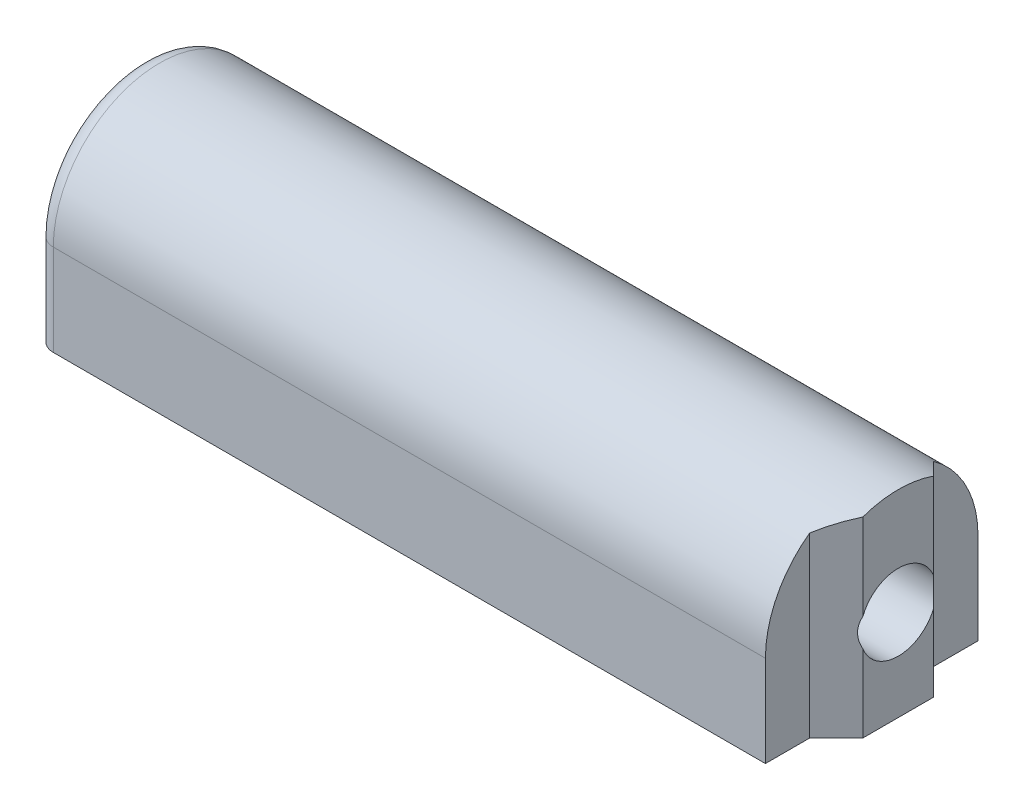
ISO-10303-21;
HEADER;
FILE_DESCRIPTION(('STEP AP214'),'2;1');
FILE_NAME('part.step','',(''),(''),'','','');
FILE_SCHEMA(('AUTOMOTIVE_DESIGN { 1 0 10303 214 1 1 1 1 }'));
ENDSEC;
DATA;
#1=APPLICATION_CONTEXT('core data for automotive mechanical design processes');
#2=APPLICATION_PROTOCOL_DEFINITION('international standard','automotive_design',2000,#1);
#3=PRODUCT_CONTEXT('',#1,'mechanical');
#4=PRODUCT('Part','Part','',(#3));
#5=PRODUCT_RELATED_PRODUCT_CATEGORY('part','',(#4));
#6=PRODUCT_DEFINITION_FORMATION('','',#4);
#7=PRODUCT_DEFINITION_CONTEXT('part definition',#1,'design');
#8=PRODUCT_DEFINITION('design','',#6,#7);
#9=PRODUCT_DEFINITION_SHAPE('','',#8);
#10=(LENGTH_UNIT() NAMED_UNIT(*) SI_UNIT(.MILLI.,.METRE.));
#11=(NAMED_UNIT(*) PLANE_ANGLE_UNIT() SI_UNIT($,.RADIAN.));
#12=(NAMED_UNIT(*) SI_UNIT($,.STERADIAN.) SOLID_ANGLE_UNIT());
#13=UNCERTAINTY_MEASURE_WITH_UNIT(LENGTH_MEASURE(1.E-05),#10,'distance_accuracy_value','');
#14=(GEOMETRIC_REPRESENTATION_CONTEXT(3) GLOBAL_UNCERTAINTY_ASSIGNED_CONTEXT((#13)) GLOBAL_UNIT_ASSIGNED_CONTEXT((#10,
#11,#12)) REPRESENTATION_CONTEXT('',''));
#15=CARTESIAN_POINT('',(0.,0.,0.));
#16=DIRECTION('',(0.,0.,1.));
#17=DIRECTION('',(1.,0.,0.));
#18=AXIS2_PLACEMENT_3D('',#15,#16,#17);
#19=CARTESIAN_POINT('',(42.7,-7.15891053163818,8.));
#20=DIRECTION('',(1.,0.,0.));
#21=DIRECTION('',(0.,0.,-1.));
#22=AXIS2_PLACEMENT_3D('',#19,#20,#21);
#23=PLANE('',#22);
#24=CARTESIAN_POINT('',(42.7,5.15,6.));
#25=DIRECTION('',(-1.,0.,0.));
#26=DIRECTION('',(0.,0.,1.));
#27=AXIS2_PLACEMENT_3D('',#24,#25,#26);
#28=CIRCLE('',#27,6.);
#29=CARTESIAN_POINT('',(42.7,10.8068542494924,4.));
#30=VERTEX_POINT('',#29);
#31=CARTESIAN_POINT('',(42.7,10.8068542494924,8.));
#32=VERTEX_POINT('',#31);
#33=EDGE_CURVE('E196',#30,#32,#28,.F.);
#34=ORIENTED_EDGE('',*,*,#33,.T.);
#35=DIRECTION('',(0.,1.,0.));
#36=VECTOR('',#35,1.);
#37=CARTESIAN_POINT('',(42.7,-7.15891053163818,8.));
#38=LINE('',#37,#36);
#39=CARTESIAN_POINT('',(42.7,5.93898669190298,8.));
#40=VERTEX_POINT('',#39);
#41=EDGE_CURVE('E182',#40,#32,#38,.T.);
#42=ORIENTED_EDGE('',*,*,#41,.F.);
#43=CARTESIAN_POINT('',(42.7,5.15,6.));
#44=DIRECTION('',(-1.,0.,0.));
#45=DIRECTION('',(0.,0.,1.));
#46=AXIS2_PLACEMENT_3D('',#43,#44,#45);
#47=CIRCLE('',#46,2.15);
#48=CARTESIAN_POINT('',(42.7,5.93898669190298,4.));
#49=VERTEX_POINT('',#48);
#50=EDGE_CURVE('E191',#40,#49,#47,.T.);
#51=ORIENTED_EDGE('',*,*,#50,.T.);
#52=DIRECTION('',(0.,1.,0.));
#53=VECTOR('',#52,1.);
#54=CARTESIAN_POINT('',(42.7,-7.15891053163818,4.));
#55=LINE('',#54,#53);
#56=EDGE_CURVE('E259',#49,#30,#55,.T.);
#57=ORIENTED_EDGE('',*,*,#56,.T.);
#58=EDGE_LOOP('',(#34,#42,#51,#57));
#59=FACE_BOUND('',#58,.T.);
#60=ADVANCED_FACE('F34',(#59),#23,.T.);
#61=CARTESIAN_POINT('',(0.,0.,12.));
#62=DIRECTION('',(1.,0.,0.));
#63=DIRECTION('',(0.,0.,-1.));
#64=AXIS2_PLACEMENT_3D('',#61,#62,#63);
#65=PLANE('',#64);
#66=CARTESIAN_POINT('',(0.,5.15,6.));
#67=DIRECTION('',(-1.,0.,0.));
#68=DIRECTION('',(0.,0.,1.));
#69=AXIS2_PLACEMENT_3D('',#66,#67,#68);
#70=CIRCLE('',#69,2.15);
#71=CARTESIAN_POINT('',(0.,5.15,8.15));
#72=VERTEX_POINT('',#71);
#73=EDGE_CURVE('E136',#72,#72,#70,.T.);
#74=ORIENTED_EDGE('',*,*,#73,.F.);
#75=EDGE_LOOP('',(#74));
#76=FACE_BOUND('',#75,.T.);
#77=CARTESIAN_POINT('',(0.,5.15,6.));
#78=DIRECTION('',(1.,0.,0.));
#79=DIRECTION('',(0.,0.,-1.));
#80=AXIS2_PLACEMENT_3D('',#77,#78,#79);
#81=CIRCLE('',#80,5.);
#82=CARTESIAN_POINT('',(0.,5.15,11.));
#83=VERTEX_POINT('',#82);
#84=CARTESIAN_POINT('',(0.,5.15,1.));
#85=VERTEX_POINT('',#84);
#86=EDGE_CURVE('E203',#83,#85,#81,.F.);
#87=ORIENTED_EDGE('',*,*,#86,.T.);
#88=DIRECTION('',(0.,-1.,0.));
#89=VECTOR('',#88,1.);
#90=CARTESIAN_POINT('',(0.,0.,1.));
#91=LINE('',#90,#89);
#92=CARTESIAN_POINT('',(0.,0.,1.));
#93=VERTEX_POINT('',#92);
#94=EDGE_CURVE('E205',#85,#93,#91,.T.);
#95=ORIENTED_EDGE('',*,*,#94,.T.);
#96=DIRECTION('',(0.,0.,-1.));
#97=VECTOR('',#96,1.);
#98=CARTESIAN_POINT('',(0.,0.,12.));
#99=LINE('',#98,#97);
#100=CARTESIAN_POINT('',(0.,0.,11.));
#101=VERTEX_POINT('',#100);
#102=EDGE_CURVE('E160',#101,#93,#99,.T.);
#103=ORIENTED_EDGE('',*,*,#102,.F.);
#104=DIRECTION('',(0.,-1.,0.));
#105=VECTOR('',#104,1.);
#106=CARTESIAN_POINT('',(0.,0.,11.));
#107=LINE('',#106,#105);
#108=EDGE_CURVE('E201',#101,#83,#107,.F.);
#109=ORIENTED_EDGE('',*,*,#108,.T.);
#110=EDGE_LOOP('',(#87,#95,#103,#109));
#111=FACE_BOUND('',#110,.T.);
#112=ADVANCED_FACE('F221',(#76,#111),#65,.F.);
#113=CARTESIAN_POINT('',(41.2,0.,12.));
#114=DIRECTION('',(-1.,0.,0.));
#115=DIRECTION('',(0.,0.,1.));
#116=AXIS2_PLACEMENT_3D('',#113,#114,#115);
#117=PLANE('',#116);
#118=DIRECTION('',(0.,1.,0.));
#119=VECTOR('',#118,1.);
#120=CARTESIAN_POINT('',(41.2,-7.15891053163818,9.5));
#121=LINE('',#120,#119);
#122=CARTESIAN_POINT('',(41.2,0.,9.5));
#123=VERTEX_POINT('',#122);
#124=CARTESIAN_POINT('',(41.2,10.0233971724045,9.5));
#125=VERTEX_POINT('',#124);
#126=EDGE_CURVE('E179',#123,#125,#121,.T.);
#127=ORIENTED_EDGE('',*,*,#126,.T.);
#128=CARTESIAN_POINT('',(41.2,5.15,6.));
#129=DIRECTION('',(-1.,0.,0.));
#130=DIRECTION('',(0.,0.,1.));
#131=AXIS2_PLACEMENT_3D('',#128,#129,#130);
#132=CIRCLE('',#131,6.);
#133=CARTESIAN_POINT('',(41.2,5.15,12.));
#134=VERTEX_POINT('',#133);
#135=EDGE_CURVE('E199',#125,#134,#132,.F.);
#136=ORIENTED_EDGE('',*,*,#135,.T.);
#137=DIRECTION('',(0.,1.,0.));
#138=VECTOR('',#137,1.);
#139=CARTESIAN_POINT('',(41.2,0.,12.));
#140=LINE('',#139,#138);
#141=CARTESIAN_POINT('',(41.2,0.,12.));
#142=VERTEX_POINT('',#141);
#143=EDGE_CURVE('E152',#142,#134,#140,.T.);
#144=ORIENTED_EDGE('',*,*,#143,.F.);
#145=DIRECTION('',(0.,0.,-1.));
#146=VECTOR('',#145,1.);
#147=CARTESIAN_POINT('',(41.2,0.,12.));
#148=LINE('',#147,#146);
#149=EDGE_CURVE('E165',#142,#123,#148,.T.);
#150=ORIENTED_EDGE('',*,*,#149,.T.);
#151=EDGE_LOOP('',(#127,#136,#144,#150));
#152=FACE_BOUND('',#151,.T.);
#153=ADVANCED_FACE('F254',(#152),#117,.F.);
#154=CARTESIAN_POINT('',(0.,0.,12.));
#155=DIRECTION('',(0.,0.,-1.));
#156=DIRECTION('',(-1.,0.,0.));
#157=AXIS2_PLACEMENT_3D('',#154,#155,#156);
#158=PLANE('',#157);
#159=DIRECTION('',(-1.,0.,0.));
#160=VECTOR('',#159,1.);
#161=CARTESIAN_POINT('',(42.700025,5.15,12.));
#162=LINE('',#161,#160);
#163=CARTESIAN_POINT('',(1.,5.15,12.));
#164=VERTEX_POINT('',#163);
#165=EDGE_CURVE('E143',#134,#164,#162,.T.);
#166=ORIENTED_EDGE('',*,*,#165,.T.);
#167=DIRECTION('',(0.,-1.,0.));
#168=VECTOR('',#167,1.);
#169=CARTESIAN_POINT('',(1.,0.,12.));
#170=LINE('',#169,#168);
#171=CARTESIAN_POINT('',(1.,0.,12.));
#172=VERTEX_POINT('',#171);
#173=EDGE_CURVE('E11',#164,#172,#170,.T.);
#174=ORIENTED_EDGE('',*,*,#173,.T.);
#175=DIRECTION('',(1.,0.,0.));
#176=VECTOR('',#175,1.);
#177=CARTESIAN_POINT('',(0.,0.,12.));
#178=LINE('',#177,#176);
#179=EDGE_CURVE('E149',#172,#142,#178,.T.);
#180=ORIENTED_EDGE('',*,*,#179,.T.);
#181=ORIENTED_EDGE('',*,*,#143,.T.);
#182=EDGE_LOOP('',(#166,#174,#180,#181));
#183=FACE_BOUND('',#182,.T.);
#184=ADVANCED_FACE('F228',(#183),#158,.F.);
#185=CARTESIAN_POINT('',(42.7,-7.15891053163818,4.));
#186=DIRECTION('',(0.707106781186547,0.,-0.707106781186548));
#187=DIRECTION('',(-0.707106781186548,0.,-0.707106781186547));
#188=AXIS2_PLACEMENT_3D('',#185,#186,#187);
#189=PLANE('',#188);
#190=CARTESIAN_POINT('',(44.7,5.15,6.));
#191=DIRECTION('',(0.707106781186547,0.,-0.707106781186548));
#192=DIRECTION('',(-0.707106781186548,0.,-0.707106781186547));
#193=AXIS2_PLACEMENT_3D('',#190,#191,#192);
#194=ELLIPSE('',#193,8.48528137423857,6.);
#195=CARTESIAN_POINT('',(41.2,10.0233971724045,2.5));
#196=VERTEX_POINT('',#195);
#197=EDGE_CURVE('E132',#30,#196,#194,.F.);
#198=ORIENTED_EDGE('',*,*,#197,.F.);
#199=ORIENTED_EDGE('',*,*,#56,.F.);
#200=CARTESIAN_POINT('',(44.7,5.15,6.));
#201=DIRECTION('',(0.707106781186547,0.,-0.707106781186548));
#202=DIRECTION('',(-0.707106781186548,0.,-0.707106781186547));
#203=AXIS2_PLACEMENT_3D('',#200,#201,#202);
#204=ELLIPSE('',#203,3.04055915910216,2.15);
#205=CARTESIAN_POINT('',(42.7,4.36101330809702,4.));
#206=VERTEX_POINT('',#205);
#207=EDGE_CURVE('E183',#206,#49,#204,.T.);
#208=ORIENTED_EDGE('',*,*,#207,.F.);
#209=CARTESIAN_POINT('',(42.7,0.,4.));
#210=VERTEX_POINT('',#209);
#211=EDGE_CURVE('E241',#210,#206,#55,.T.);
#212=ORIENTED_EDGE('',*,*,#211,.F.);
#213=DIRECTION('',(0.707106781186548,0.,0.707106781186547));
#214=VECTOR('',#213,1.);
#215=CARTESIAN_POINT('',(42.7,0.,4.));
#216=LINE('',#215,#214);
#217=CARTESIAN_POINT('',(41.2,0.,2.5));
#218=VERTEX_POINT('',#217);
#219=EDGE_CURVE('E238',#218,#210,#216,.T.);
#220=ORIENTED_EDGE('',*,*,#219,.F.);
#221=DIRECTION('',(0.,1.,0.));
#222=VECTOR('',#221,1.);
#223=CARTESIAN_POINT('',(41.2,-7.15891053163818,2.5));
#224=LINE('',#223,#222);
#225=EDGE_CURVE('E239',#218,#196,#224,.T.);
#226=ORIENTED_EDGE('',*,*,#225,.T.);
#227=EDGE_LOOP('',(#198,#199,#208,#212,#220,#226));
#228=FACE_BOUND('',#227,.T.);
#229=ADVANCED_FACE('F268',(#228),#189,.T.);
#230=CARTESIAN_POINT('',(42.7,-7.15891053163818,8.));
#231=DIRECTION('',(0.707106781186547,0.,0.707106781186547));
#232=DIRECTION('',(0.707106781186548,0.,-0.707106781186548));
#233=AXIS2_PLACEMENT_3D('',#230,#231,#232);
#234=PLANE('',#233);
#235=CARTESIAN_POINT('',(44.7,5.15,6.));
#236=DIRECTION('',(0.707106781186547,0.,0.707106781186547));
#237=DIRECTION('',(-0.707106781186548,0.,0.707106781186548));
#238=AXIS2_PLACEMENT_3D('',#235,#236,#237);
#239=ELLIPSE('',#238,8.48528137423857,6.);
#240=EDGE_CURVE('E187',#125,#32,#239,.F.);
#241=ORIENTED_EDGE('',*,*,#240,.F.);
#242=ORIENTED_EDGE('',*,*,#126,.F.);
#243=DIRECTION('',(-0.707106781186548,0.,0.707106781186548));
#244=VECTOR('',#243,1.);
#245=CARTESIAN_POINT('',(42.7,0.,8.));
#246=LINE('',#245,#244);
#247=CARTESIAN_POINT('',(42.7,0.,8.));
#248=VERTEX_POINT('',#247);
#249=EDGE_CURVE('E154',#248,#123,#246,.T.);
#250=ORIENTED_EDGE('',*,*,#249,.F.);
#251=CARTESIAN_POINT('',(42.7,4.36101330809702,8.));
#252=VERTEX_POINT('',#251);
#253=EDGE_CURVE('E176',#248,#252,#38,.T.);
#254=ORIENTED_EDGE('',*,*,#253,.T.);
#255=CARTESIAN_POINT('',(44.7,5.15,6.));
#256=DIRECTION('',(0.707106781186547,0.,0.707106781186547));
#257=DIRECTION('',(-0.707106781186548,0.,0.707106781186548));
#258=AXIS2_PLACEMENT_3D('',#255,#256,#257);
#259=ELLIPSE('',#258,3.04055915910216,2.15);
#260=EDGE_CURVE('E171',#40,#252,#259,.T.);
#261=ORIENTED_EDGE('',*,*,#260,.F.);
#262=ORIENTED_EDGE('',*,*,#41,.T.);
#263=EDGE_LOOP('',(#241,#242,#250,#254,#261,#262));
#264=FACE_BOUND('',#263,.T.);
#265=ADVANCED_FACE('F252',(#264),#234,.T.);
#266=DIRECTION('',(0.,1.,0.));
#267=VECTOR('',#266,1.);
#268=CARTESIAN_POINT('',(41.2,0.,0.));
#269=LINE('',#268,#267);
#270=CARTESIAN_POINT('',(41.2,0.,0.));
#271=VERTEX_POINT('',#270);
#272=CARTESIAN_POINT('',(41.2,5.15,0.));
#273=VERTEX_POINT('',#272);
#274=EDGE_CURVE('E141',#271,#273,#269,.T.);
#275=ORIENTED_EDGE('',*,*,#274,.T.);
#276=CARTESIAN_POINT('',(41.2,5.15,6.));
#277=DIRECTION('',(-1.,0.,0.));
#278=DIRECTION('',(0.,0.,1.));
#279=AXIS2_PLACEMENT_3D('',#276,#277,#278);
#280=CIRCLE('',#279,6.);
#281=EDGE_CURVE('E125',#273,#196,#280,.F.);
#282=ORIENTED_EDGE('',*,*,#281,.T.);
#283=ORIENTED_EDGE('',*,*,#225,.F.);
#284=EDGE_CURVE('E148',#218,#271,#148,.T.);
#285=ORIENTED_EDGE('',*,*,#284,.T.);
#286=EDGE_LOOP('',(#275,#282,#283,#285));
#287=FACE_BOUND('',#286,.T.);
#288=ADVANCED_FACE('F146',(#287),#117,.F.);
#289=CARTESIAN_POINT('',(0.,0.,12.));
#290=DIRECTION('',(0.,1.,0.));
#291=DIRECTION('',(0.,0.,1.));
#292=AXIS2_PLACEMENT_3D('',#289,#290,#291);
#293=PLANE('',#292);
#294=ORIENTED_EDGE('',*,*,#102,.T.);
#295=CARTESIAN_POINT('',(1.,0.,1.));
#296=DIRECTION('',(0.,1.,0.));
#297=DIRECTION('',(0.,0.,1.));
#298=AXIS2_PLACEMENT_3D('',#295,#296,#297);
#299=CIRCLE('',#298,1.);
#300=CARTESIAN_POINT('',(1.,0.,0.));
#301=VERTEX_POINT('',#300);
#302=EDGE_CURVE('E57',#93,#301,#299,.F.);
#303=ORIENTED_EDGE('',*,*,#302,.T.);
#304=DIRECTION('',(1.,0.,0.));
#305=VECTOR('',#304,1.);
#306=CARTESIAN_POINT('',(0.,0.,0.));
#307=LINE('',#306,#305);
#308=EDGE_CURVE('E150',#301,#271,#307,.T.);
#309=ORIENTED_EDGE('',*,*,#308,.T.);
#310=ORIENTED_EDGE('',*,*,#284,.F.);
#311=ORIENTED_EDGE('',*,*,#219,.T.);
#312=DIRECTION('',(0.,0.,1.));
#313=VECTOR('',#312,1.);
#314=CARTESIAN_POINT('',(42.7,0.,8.));
#315=LINE('',#314,#313);
#316=EDGE_CURVE('E236',#210,#248,#315,.T.);
#317=ORIENTED_EDGE('',*,*,#316,.T.);
#318=ORIENTED_EDGE('',*,*,#249,.T.);
#319=ORIENTED_EDGE('',*,*,#149,.F.);
#320=ORIENTED_EDGE('',*,*,#179,.F.);
#321=CARTESIAN_POINT('',(1.,0.,11.));
#322=DIRECTION('',(0.,1.,0.));
#323=DIRECTION('',(0.,0.,1.));
#324=AXIS2_PLACEMENT_3D('',#321,#322,#323);
#325=CIRCLE('',#324,1.);
#326=EDGE_CURVE('E207',#172,#101,#325,.F.);
#327=ORIENTED_EDGE('',*,*,#326,.T.);
#328=EDGE_LOOP('',(#294,#303,#309,#310,#311,#317,#318,#319,#320,#327));
#329=FACE_BOUND('',#328,.T.);
#330=ADVANCED_FACE('F223',(#329),#293,.F.);
#331=CARTESIAN_POINT('',(0.,0.,0.));
#332=DIRECTION('',(0.,0.,-1.));
#333=DIRECTION('',(-1.,0.,0.));
#334=AXIS2_PLACEMENT_3D('',#331,#332,#333);
#335=PLANE('',#334);
#336=ORIENTED_EDGE('',*,*,#308,.F.);
#337=DIRECTION('',(0.,-1.,0.));
#338=VECTOR('',#337,1.);
#339=CARTESIAN_POINT('',(1.,5.15,0.));
#340=LINE('',#339,#338);
#341=CARTESIAN_POINT('',(1.,5.15,0.));
#342=VERTEX_POINT('',#341);
#343=EDGE_CURVE('E43',#301,#342,#340,.F.);
#344=ORIENTED_EDGE('',*,*,#343,.T.);
#345=DIRECTION('',(-1.,0.,0.));
#346=VECTOR('',#345,1.);
#347=CARTESIAN_POINT('',(42.700025,5.15,0.));
#348=LINE('',#347,#346);
#349=EDGE_CURVE('E129',#273,#342,#348,.T.);
#350=ORIENTED_EDGE('',*,*,#349,.F.);
#351=ORIENTED_EDGE('',*,*,#274,.F.);
#352=EDGE_LOOP('',(#336,#344,#350,#351));
#353=FACE_BOUND('',#352,.T.);
#354=ADVANCED_FACE('F140',(#353),#335,.T.);
#355=CARTESIAN_POINT('',(42.7,5.15,6.));
#356=DIRECTION('',(-1.,0.,0.));
#357=DIRECTION('',(0.,0.,1.));
#358=AXIS2_PLACEMENT_3D('',#355,#356,#357);
#359=CIRCLE('',#358,2.15);
#360=EDGE_CURVE('E188',#206,#252,#359,.T.);
#361=ORIENTED_EDGE('',*,*,#360,.T.);
#362=ORIENTED_EDGE('',*,*,#253,.F.);
#363=ORIENTED_EDGE('',*,*,#316,.F.);
#364=ORIENTED_EDGE('',*,*,#211,.T.);
#365=EDGE_LOOP('',(#361,#362,#363,#364));
#366=FACE_BOUND('',#365,.T.);
#367=ADVANCED_FACE('F264',(#366),#23,.T.);
#368=CARTESIAN_POINT('',(42.700025,5.15,6.));
#369=DIRECTION('',(-1.,0.,0.));
#370=DIRECTION('',(0.,0.,1.));
#371=AXIS2_PLACEMENT_3D('',#368,#369,#370);
#372=CYLINDRICAL_SURFACE('',#371,2.15);
#373=ORIENTED_EDGE('',*,*,#207,.T.);
#374=ORIENTED_EDGE('',*,*,#50,.F.);
#375=ORIENTED_EDGE('',*,*,#260,.T.);
#376=ORIENTED_EDGE('',*,*,#360,.F.);
#377=EDGE_LOOP('',(#373,#374,#375,#376));
#378=FACE_BOUND('',#377,.T.);
#379=ORIENTED_EDGE('',*,*,#73,.T.);
#380=EDGE_LOOP('',(#379));
#381=FACE_BOUND('',#380,.T.);
#382=ADVANCED_FACE('F270',(#378,#381),#372,.F.);
#383=CARTESIAN_POINT('',(42.700025,5.15,6.));
#384=DIRECTION('',(-1.,0.,0.));
#385=DIRECTION('',(0.,0.,1.));
#386=AXIS2_PLACEMENT_3D('',#383,#384,#385);
#387=CYLINDRICAL_SURFACE('',#386,6.);
#388=ORIENTED_EDGE('',*,*,#349,.T.);
#389=CARTESIAN_POINT('',(1.,5.15,6.));
#390=DIRECTION('',(1.,0.,0.));
#391=DIRECTION('',(0.,0.,-1.));
#392=AXIS2_PLACEMENT_3D('',#389,#390,#391);
#393=CIRCLE('',#392,6.);
#394=EDGE_CURVE('E195',#342,#164,#393,.T.);
#395=ORIENTED_EDGE('',*,*,#394,.T.);
#396=ORIENTED_EDGE('',*,*,#165,.F.);
#397=ORIENTED_EDGE('',*,*,#135,.F.);
#398=ORIENTED_EDGE('',*,*,#240,.T.);
#399=ORIENTED_EDGE('',*,*,#33,.F.);
#400=ORIENTED_EDGE('',*,*,#197,.T.);
#401=ORIENTED_EDGE('',*,*,#281,.F.);
#402=EDGE_LOOP('',(#388,#395,#396,#397,#398,#399,#400,#401));
#403=FACE_BOUND('',#402,.T.);
#404=ADVANCED_FACE('F127',(#403),#387,.T.);
#405=CARTESIAN_POINT('',(1.,0.,1.));
#406=DIRECTION('',(0.,1.,0.));
#407=DIRECTION('',(0.,0.,1.));
#408=AXIS2_PLACEMENT_3D('',#405,#406,#407);
#409=CYLINDRICAL_SURFACE('',#408,1.);
#410=ORIENTED_EDGE('',*,*,#302,.F.);
#411=ORIENTED_EDGE('',*,*,#94,.F.);
#412=CARTESIAN_POINT('',(1.,5.15,1.));
#413=DIRECTION('',(0.,1.,0.));
#414=DIRECTION('',(0.,0.,1.));
#415=AXIS2_PLACEMENT_3D('',#412,#413,#414);
#416=CIRCLE('',#415,1.);
#417=EDGE_CURVE('E38',#342,#85,#416,.T.);
#418=ORIENTED_EDGE('',*,*,#417,.F.);
#419=ORIENTED_EDGE('',*,*,#343,.F.);
#420=EDGE_LOOP('',(#410,#411,#418,#419));
#421=FACE_BOUND('',#420,.T.);
#422=ADVANCED_FACE('F36',(#421),#409,.T.);
#423=CARTESIAN_POINT('',(1.,0.,11.));
#424=DIRECTION('',(0.,-1.,0.));
#425=DIRECTION('',(0.,0.,-1.));
#426=AXIS2_PLACEMENT_3D('',#423,#424,#425);
#427=CYLINDRICAL_SURFACE('',#426,1.);
#428=ORIENTED_EDGE('',*,*,#326,.F.);
#429=ORIENTED_EDGE('',*,*,#173,.F.);
#430=CARTESIAN_POINT('',(1.,5.15,11.));
#431=DIRECTION('',(0.,1.,0.));
#432=DIRECTION('',(0.,0.,1.));
#433=AXIS2_PLACEMENT_3D('',#430,#431,#432);
#434=CIRCLE('',#433,1.);
#435=EDGE_CURVE('E210',#83,#164,#434,.T.);
#436=ORIENTED_EDGE('',*,*,#435,.F.);
#437=ORIENTED_EDGE('',*,*,#108,.F.);
#438=EDGE_LOOP('',(#428,#429,#436,#437));
#439=FACE_BOUND('',#438,.T.);
#440=ADVANCED_FACE('F226',(#439),#427,.T.);
#441=CARTESIAN_POINT('',(1.,5.15,6.));
#442=DIRECTION('',(1.,0.,0.));
#443=DIRECTION('',(0.,0.,-1.));
#444=AXIS2_PLACEMENT_3D('',#441,#442,#443);
#445=TOROIDAL_SURFACE('',#444,5.,1.);
#446=ORIENTED_EDGE('',*,*,#417,.T.);
#447=ORIENTED_EDGE('',*,*,#86,.F.);
#448=ORIENTED_EDGE('',*,*,#435,.T.);
#449=ORIENTED_EDGE('',*,*,#394,.F.);
#450=EDGE_LOOP('',(#446,#447,#448,#449));
#451=FACE_BOUND('',#450,.T.);
#452=ADVANCED_FACE('F216',(#451),#445,.T.);
#453=CLOSED_SHELL('',(#60,#112,#153,#184,#229,#265,#288,#330,#354,#367,#382,#404,#422,#440,#452));
#454=MANIFOLD_SOLID_BREP('B2',#453);
#455=ADVANCED_BREP_SHAPE_REPRESENTATION('',(#18,#454),#14);
#456=SHAPE_DEFINITION_REPRESENTATION(#9,#455);
ENDSEC;
END-ISO-10303-21;
